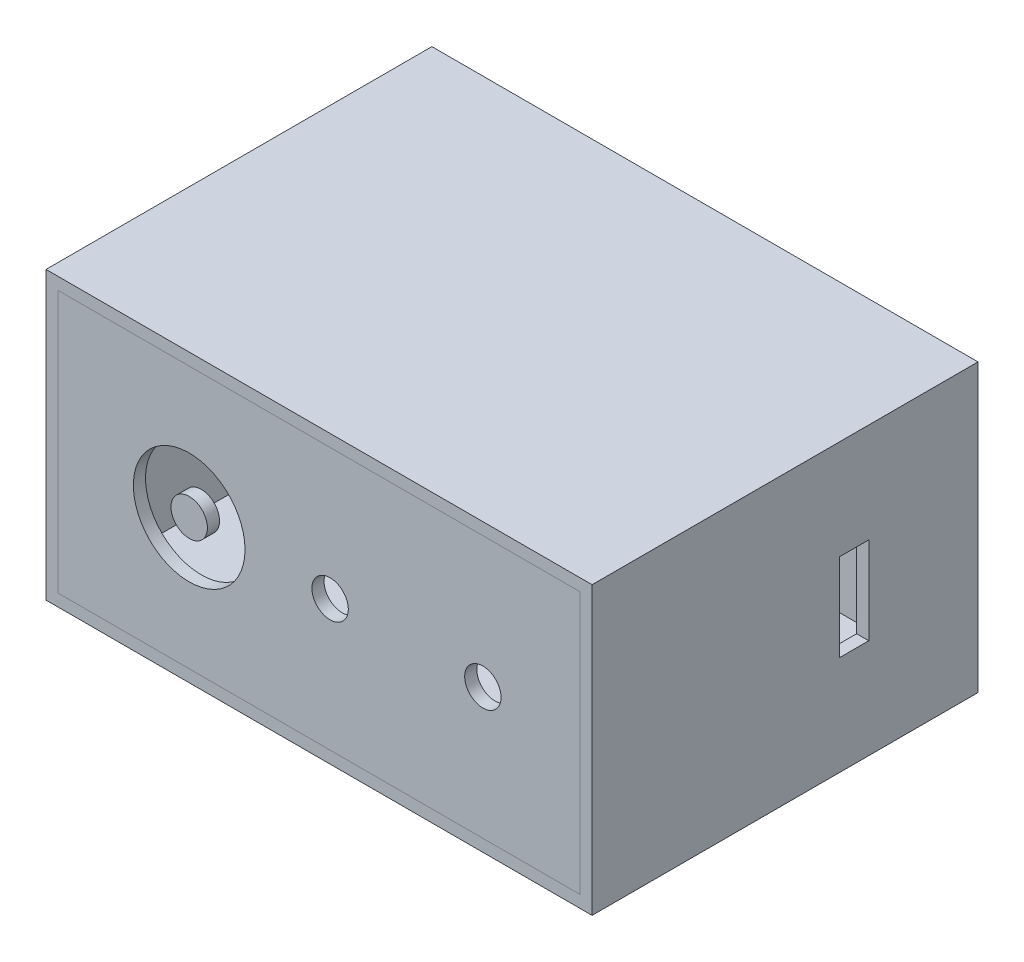
ISO-10303-21;
HEADER;
FILE_DESCRIPTION(('STEP AP214'),'2;1');
FILE_NAME('part.step','',(''),(''),'','','');
FILE_SCHEMA(('AUTOMOTIVE_DESIGN { 1 0 10303 214 1 1 1 1 }'));
ENDSEC;
DATA;
#1=APPLICATION_CONTEXT('core data for automotive mechanical design processes');
#2=APPLICATION_PROTOCOL_DEFINITION('international standard','automotive_design',2000,#1);
#3=PRODUCT_CONTEXT('',#1,'mechanical');
#4=PRODUCT('Part','Part','',(#3));
#5=PRODUCT_RELATED_PRODUCT_CATEGORY('part','',(#4));
#6=PRODUCT_DEFINITION_FORMATION('','',#4);
#7=PRODUCT_DEFINITION_CONTEXT('part definition',#1,'design');
#8=PRODUCT_DEFINITION('design','',#6,#7);
#9=PRODUCT_DEFINITION_SHAPE('','',#8);
#10=(LENGTH_UNIT() NAMED_UNIT(*) SI_UNIT(.MILLI.,.METRE.));
#11=(NAMED_UNIT(*) PLANE_ANGLE_UNIT() SI_UNIT($,.RADIAN.));
#12=(NAMED_UNIT(*) SI_UNIT($,.STERADIAN.) SOLID_ANGLE_UNIT());
#13=UNCERTAINTY_MEASURE_WITH_UNIT(LENGTH_MEASURE(1.E-05),#10,'distance_accuracy_value','');
#14=(GEOMETRIC_REPRESENTATION_CONTEXT(3) GLOBAL_UNCERTAINTY_ASSIGNED_CONTEXT((#13)) GLOBAL_UNIT_ASSIGNED_CONTEXT((#10,
#11,#12)) REPRESENTATION_CONTEXT('',''));
#15=CARTESIAN_POINT('',(0.,0.,0.));
#16=DIRECTION('',(0.,0.,1.));
#17=DIRECTION('',(1.,0.,0.));
#18=AXIS2_PLACEMENT_3D('',#15,#16,#17);
#19=CARTESIAN_POINT('',(0.,0.,0.5));
#20=DIRECTION('',(0.,0.,-1.));
#21=DIRECTION('',(-1.,0.,0.));
#22=AXIS2_PLACEMENT_3D('',#19,#20,#21);
#23=PLANE('',#22);
#24=DIRECTION('',(1.,0.,0.));
#25=VECTOR('',#24,1.);
#26=CARTESIAN_POINT('',(-11.25,5.4,0.5));
#27=LINE('',#26,#25);
#28=CARTESIAN_POINT('',(-10.75,5.4,0.5));
#29=VERTEX_POINT('',#28);
#30=CARTESIAN_POINT('',(10.75,5.4,0.5));
#31=VERTEX_POINT('',#30);
#32=EDGE_CURVE('P0_E115',#29,#31,#27,.T.);
#33=ORIENTED_EDGE('',*,*,#32,.F.);
#34=DIRECTION('',(0.,1.,0.));
#35=VECTOR('',#34,1.);
#36=CARTESIAN_POINT('',(-10.75,-5.9,0.5));
#37=LINE('',#36,#35);
#38=CARTESIAN_POINT('',(-10.75,-5.4,0.5));
#39=VERTEX_POINT('',#38);
#40=EDGE_CURVE('P0_E106',#39,#29,#37,.T.);
#41=ORIENTED_EDGE('',*,*,#40,.F.);
#42=DIRECTION('',(1.,0.,0.));
#43=VECTOR('',#42,1.);
#44=CARTESIAN_POINT('',(-11.25,-5.4,0.5));
#45=LINE('',#44,#43);
#46=CARTESIAN_POINT('',(10.75,-5.4,0.5));
#47=VERTEX_POINT('',#46);
#48=EDGE_CURVE('P0_E101',#47,#39,#45,.F.);
#49=ORIENTED_EDGE('',*,*,#48,.F.);
#50=DIRECTION('',(0.,1.,0.));
#51=VECTOR('',#50,1.);
#52=CARTESIAN_POINT('',(10.75,-5.9,0.5));
#53=LINE('',#52,#51);
#54=EDGE_CURVE('P0_E118',#31,#47,#53,.F.);
#55=ORIENTED_EDGE('',*,*,#54,.F.);
#56=EDGE_LOOP('',(#33,#41,#49,#55));
#57=FACE_BOUND('',#56,.T.);
#58=ADVANCED_FACE('P0_F16',(#57),#23,.F.);
#59=CARTESIAN_POINT('',(6.35,-1.8,5.7));
#60=DIRECTION('',(0.,0.,1.));
#61=DIRECTION('',(1.,0.,0.));
#62=AXIS2_PLACEMENT_3D('',#59,#60,#61);
#63=PLANE('',#62);
#64=DIRECTION('',(1.,0.,0.));
#65=VECTOR('',#64,1.);
#66=CARTESIAN_POINT('',(6.35,1.8,5.7));
#67=LINE('',#66,#65);
#68=CARTESIAN_POINT('',(10.75,1.8,5.7));
#69=VERTEX_POINT('',#68);
#70=CARTESIAN_POINT('',(11.25,1.8,5.7));
#71=VERTEX_POINT('',#70);
#72=EDGE_CURVE('P0_E133',#69,#71,#67,.T.);
#73=ORIENTED_EDGE('',*,*,#72,.T.);
#74=DIRECTION('',(0.,1.,0.));
#75=VECTOR('',#74,1.);
#76=CARTESIAN_POINT('',(11.25,-5.9,5.7));
#77=LINE('',#76,#75);
#78=CARTESIAN_POINT('',(11.25,-1.8,5.7));
#79=VERTEX_POINT('',#78);
#80=EDGE_CURVE('P0_E146',#71,#79,#77,.F.);
#81=ORIENTED_EDGE('',*,*,#80,.T.);
#82=DIRECTION('',(1.,0.,0.));
#83=VECTOR('',#82,1.);
#84=CARTESIAN_POINT('',(6.35,-1.8,5.7));
#85=LINE('',#84,#83);
#86=CARTESIAN_POINT('',(10.75,-1.8,5.7));
#87=VERTEX_POINT('',#86);
#88=EDGE_CURVE('P0_E19',#79,#87,#85,.F.);
#89=ORIENTED_EDGE('',*,*,#88,.T.);
#90=DIRECTION('',(0.,1.,0.));
#91=VECTOR('',#90,1.);
#92=CARTESIAN_POINT('',(10.75,-5.9,5.7));
#93=LINE('',#92,#91);
#94=EDGE_CURVE('P0_E145',#69,#87,#93,.F.);
#95=ORIENTED_EDGE('',*,*,#94,.F.);
#96=EDGE_LOOP('',(#73,#81,#89,#95));
#97=FACE_BOUND('',#96,.T.);
#98=ADVANCED_FACE('P0_F144',(#97),#63,.F.);
#99=CARTESIAN_POINT('',(6.35,-1.8,5.7));
#100=DIRECTION('',(0.,-1.,0.));
#101=DIRECTION('',(0.,0.,-1.));
#102=AXIS2_PLACEMENT_3D('',#99,#100,#101);
#103=PLANE('',#102);
#104=ORIENTED_EDGE('',*,*,#88,.F.);
#105=DIRECTION('',(0.,0.,1.));
#106=VECTOR('',#105,1.);
#107=CARTESIAN_POINT('',(11.25,-1.8,15.9));
#108=LINE('',#107,#106);
#109=CARTESIAN_POINT('',(11.25,-1.8,4.5));
#110=VERTEX_POINT('',#109);
#111=EDGE_CURVE('P0_E192',#79,#110,#108,.F.);
#112=ORIENTED_EDGE('',*,*,#111,.T.);
#113=DIRECTION('',(-1.,0.,0.));
#114=VECTOR('',#113,1.);
#115=CARTESIAN_POINT('',(6.35,-1.8,4.5));
#116=LINE('',#115,#114);
#117=CARTESIAN_POINT('',(10.75,-1.8,4.5));
#118=VERTEX_POINT('',#117);
#119=EDGE_CURVE('P0_E135',#110,#118,#116,.T.);
#120=ORIENTED_EDGE('',*,*,#119,.T.);
#121=DIRECTION('',(0.,0.,1.));
#122=VECTOR('',#121,1.);
#123=CARTESIAN_POINT('',(10.75,-1.8,15.9));
#124=LINE('',#123,#122);
#125=EDGE_CURVE('P0_E148',#87,#118,#124,.F.);
#126=ORIENTED_EDGE('',*,*,#125,.F.);
#127=EDGE_LOOP('',(#104,#112,#120,#126));
#128=FACE_BOUND('',#127,.T.);
#129=ADVANCED_FACE('P0_F149',(#128),#103,.F.);
#130=CARTESIAN_POINT('',(6.35,-1.8,4.5));
#131=DIRECTION('',(0.,0.,-1.));
#132=DIRECTION('',(-1.,0.,0.));
#133=AXIS2_PLACEMENT_3D('',#130,#131,#132);
#134=PLANE('',#133);
#135=ORIENTED_EDGE('',*,*,#119,.F.);
#136=DIRECTION('',(0.,1.,0.));
#137=VECTOR('',#136,1.);
#138=CARTESIAN_POINT('',(11.25,-5.9,4.5));
#139=LINE('',#138,#137);
#140=CARTESIAN_POINT('',(11.25,1.8,4.5));
#141=VERTEX_POINT('',#140);
#142=EDGE_CURVE('P0_E189',#110,#141,#139,.T.);
#143=ORIENTED_EDGE('',*,*,#142,.T.);
#144=DIRECTION('',(1.,0.,0.));
#145=VECTOR('',#144,1.);
#146=CARTESIAN_POINT('',(6.35,1.8,4.5));
#147=LINE('',#146,#145);
#148=CARTESIAN_POINT('',(10.75,1.8,4.5));
#149=VERTEX_POINT('',#148);
#150=EDGE_CURVE('P0_E122',#141,#149,#147,.F.);
#151=ORIENTED_EDGE('',*,*,#150,.T.);
#152=DIRECTION('',(0.,1.,0.));
#153=VECTOR('',#152,1.);
#154=CARTESIAN_POINT('',(10.75,-5.9,4.5));
#155=LINE('',#154,#153);
#156=EDGE_CURVE('P0_E161',#118,#149,#155,.T.);
#157=ORIENTED_EDGE('',*,*,#156,.F.);
#158=EDGE_LOOP('',(#135,#143,#151,#157));
#159=FACE_BOUND('',#158,.T.);
#160=ADVANCED_FACE('P0_F260',(#159),#134,.F.);
#161=CARTESIAN_POINT('',(6.35,1.8,5.7));
#162=DIRECTION('',(0.,1.,0.));
#163=DIRECTION('',(0.,0.,1.));
#164=AXIS2_PLACEMENT_3D('',#161,#162,#163);
#165=PLANE('',#164);
#166=ORIENTED_EDGE('',*,*,#150,.F.);
#167=DIRECTION('',(0.,0.,1.));
#168=VECTOR('',#167,1.);
#169=CARTESIAN_POINT('',(11.25,1.8,15.9));
#170=LINE('',#169,#168);
#171=EDGE_CURVE('P0_E186',#141,#71,#170,.T.);
#172=ORIENTED_EDGE('',*,*,#171,.T.);
#173=ORIENTED_EDGE('',*,*,#72,.F.);
#174=DIRECTION('',(0.,0.,1.));
#175=VECTOR('',#174,1.);
#176=CARTESIAN_POINT('',(10.75,1.8,15.9));
#177=LINE('',#176,#175);
#178=EDGE_CURVE('P0_E155',#149,#69,#177,.T.);
#179=ORIENTED_EDGE('',*,*,#178,.F.);
#180=EDGE_LOOP('',(#166,#172,#173,#179));
#181=FACE_BOUND('',#180,.T.);
#182=ADVANCED_FACE('P0_F257',(#181),#165,.F.);
#183=CARTESIAN_POINT('',(-11.25,5.4,15.9));
#184=DIRECTION('',(0.,-1.,0.));
#185=DIRECTION('',(0.,0.,-1.));
#186=AXIS2_PLACEMENT_3D('',#183,#184,#185);
#187=PLANE('',#186);
#188=DIRECTION('',(-1.,0.,0.));
#189=VECTOR('',#188,1.);
#190=CARTESIAN_POINT('',(0.,5.4,15.9));
#191=LINE('',#190,#189);
#192=CARTESIAN_POINT('',(10.75,5.4,15.9));
#193=VERTEX_POINT('',#192);
#194=CARTESIAN_POINT('',(-10.75,5.4,15.9));
#195=VERTEX_POINT('',#194);
#196=EDGE_CURVE('P0_E126',#193,#195,#191,.T.);
#197=ORIENTED_EDGE('',*,*,#196,.T.);
#198=DIRECTION('',(0.,0.,-1.));
#199=VECTOR('',#198,1.);
#200=CARTESIAN_POINT('',(-10.75,5.4,15.9));
#201=LINE('',#200,#199);
#202=EDGE_CURVE('P0_E111',#29,#195,#201,.F.);
#203=ORIENTED_EDGE('',*,*,#202,.F.);
#204=ORIENTED_EDGE('',*,*,#32,.T.);
#205=DIRECTION('',(0.,0.,1.));
#206=VECTOR('',#205,1.);
#207=CARTESIAN_POINT('',(10.75,5.4,15.9));
#208=LINE('',#207,#206);
#209=EDGE_CURVE('P0_E195',#193,#31,#208,.F.);
#210=ORIENTED_EDGE('',*,*,#209,.F.);
#211=EDGE_LOOP('',(#197,#203,#204,#210));
#212=FACE_BOUND('',#211,.T.);
#213=ADVANCED_FACE('P0_F125',(#212),#187,.T.);
#214=CARTESIAN_POINT('',(-10.75,-5.9,15.9));
#215=DIRECTION('',(1.,0.,0.));
#216=DIRECTION('',(0.,0.,-1.));
#217=AXIS2_PLACEMENT_3D('',#214,#215,#216);
#218=PLANE('',#217);
#219=DIRECTION('',(0.,1.,0.));
#220=VECTOR('',#219,1.);
#221=CARTESIAN_POINT('',(-10.75,0.,15.9));
#222=LINE('',#221,#220);
#223=CARTESIAN_POINT('',(-10.75,-5.4,15.9));
#224=VERTEX_POINT('',#223);
#225=EDGE_CURVE('P0_E170',#195,#224,#222,.F.);
#226=ORIENTED_EDGE('',*,*,#225,.T.);
#227=DIRECTION('',(0.,0.,1.));
#228=VECTOR('',#227,1.);
#229=CARTESIAN_POINT('',(-10.75,-5.4,15.9));
#230=LINE('',#229,#228);
#231=EDGE_CURVE('P0_E113',#39,#224,#230,.T.);
#232=ORIENTED_EDGE('',*,*,#231,.F.);
#233=ORIENTED_EDGE('',*,*,#40,.T.);
#234=ORIENTED_EDGE('',*,*,#202,.T.);
#235=EDGE_LOOP('',(#226,#232,#233,#234));
#236=FACE_BOUND('',#235,.T.);
#237=ADVANCED_FACE('P0_F109',(#236),#218,.T.);
#238=CARTESIAN_POINT('',(-11.25,-5.4,15.9));
#239=DIRECTION('',(0.,1.,0.));
#240=DIRECTION('',(0.,0.,1.));
#241=AXIS2_PLACEMENT_3D('',#238,#239,#240);
#242=PLANE('',#241);
#243=DIRECTION('',(-1.,0.,0.));
#244=VECTOR('',#243,1.);
#245=CARTESIAN_POINT('',(0.,-5.4,15.9));
#246=LINE('',#245,#244);
#247=CARTESIAN_POINT('',(10.75,-5.4,15.9));
#248=VERTEX_POINT('',#247);
#249=EDGE_CURVE('P0_E165',#224,#248,#246,.F.);
#250=ORIENTED_EDGE('',*,*,#249,.T.);
#251=DIRECTION('',(0.,0.,1.));
#252=VECTOR('',#251,1.);
#253=CARTESIAN_POINT('',(10.75,-5.4,15.9));
#254=LINE('',#253,#252);
#255=EDGE_CURVE('P0_E153',#47,#248,#254,.T.);
#256=ORIENTED_EDGE('',*,*,#255,.F.);
#257=ORIENTED_EDGE('',*,*,#48,.T.);
#258=ORIENTED_EDGE('',*,*,#231,.T.);
#259=EDGE_LOOP('',(#250,#256,#257,#258));
#260=FACE_BOUND('',#259,.T.);
#261=ADVANCED_FACE('P0_F164',(#260),#242,.T.);
#262=CARTESIAN_POINT('',(10.75,-5.9,15.9));
#263=DIRECTION('',(-1.,0.,0.));
#264=DIRECTION('',(0.,0.,1.));
#265=AXIS2_PLACEMENT_3D('',#262,#263,#264);
#266=PLANE('',#265);
#267=DIRECTION('',(0.,1.,0.));
#268=VECTOR('',#267,1.);
#269=CARTESIAN_POINT('',(10.75,0.,15.9));
#270=LINE('',#269,#268);
#271=EDGE_CURVE('P0_E172',#248,#193,#270,.T.);
#272=ORIENTED_EDGE('',*,*,#271,.T.);
#273=ORIENTED_EDGE('',*,*,#209,.T.);
#274=ORIENTED_EDGE('',*,*,#54,.T.);
#275=ORIENTED_EDGE('',*,*,#255,.T.);
#276=EDGE_LOOP('',(#272,#273,#274,#275));
#277=FACE_BOUND('',#276,.T.);
#278=ORIENTED_EDGE('',*,*,#94,.T.);
#279=ORIENTED_EDGE('',*,*,#125,.T.);
#280=ORIENTED_EDGE('',*,*,#156,.T.);
#281=ORIENTED_EDGE('',*,*,#178,.T.);
#282=EDGE_LOOP('',(#278,#279,#280,#281));
#283=FACE_BOUND('',#282,.T.);
#284=ADVANCED_FACE('P0_F197',(#277,#283),#266,.T.);
#285=CARTESIAN_POINT('',(-11.25,-5.9,15.9));
#286=DIRECTION('',(0.,1.,0.));
#287=DIRECTION('',(0.,0.,1.));
#288=AXIS2_PLACEMENT_3D('',#285,#286,#287);
#289=PLANE('',#288);
#290=DIRECTION('',(0.,0.,1.));
#291=VECTOR('',#290,1.);
#292=CARTESIAN_POINT('',(11.25,-5.9,15.9));
#293=LINE('',#292,#291);
#294=CARTESIAN_POINT('',(11.25,-5.9,0.));
#295=VERTEX_POINT('',#294);
#296=CARTESIAN_POINT('',(11.25,-5.9,15.9));
#297=VERTEX_POINT('',#296);
#298=EDGE_CURVE('P0_E183',#295,#297,#293,.T.);
#299=ORIENTED_EDGE('',*,*,#298,.T.);
#300=DIRECTION('',(-1.,0.,0.));
#301=VECTOR('',#300,1.);
#302=CARTESIAN_POINT('',(0.,-5.9,15.9));
#303=LINE('',#302,#301);
#304=CARTESIAN_POINT('',(-11.25,-5.9,15.9));
#305=VERTEX_POINT('',#304);
#306=EDGE_CURVE('P0_E181',#297,#305,#303,.T.);
#307=ORIENTED_EDGE('',*,*,#306,.T.);
#308=DIRECTION('',(0.,0.,-1.));
#309=VECTOR('',#308,1.);
#310=CARTESIAN_POINT('',(-11.25,-5.9,15.9));
#311=LINE('',#310,#309);
#312=CARTESIAN_POINT('',(-11.25,-5.9,0.));
#313=VERTEX_POINT('',#312);
#314=EDGE_CURVE('P0_E200',#305,#313,#311,.T.);
#315=ORIENTED_EDGE('',*,*,#314,.T.);
#316=DIRECTION('',(-1.,0.,0.));
#317=VECTOR('',#316,1.);
#318=CARTESIAN_POINT('',(0.,-5.9,0.));
#319=LINE('',#318,#317);
#320=EDGE_CURVE('P0_E208',#295,#313,#319,.T.);
#321=ORIENTED_EDGE('',*,*,#320,.F.);
#322=EDGE_LOOP('',(#299,#307,#315,#321));
#323=FACE_BOUND('',#322,.T.);
#324=ADVANCED_FACE('P0_F245',(#323),#289,.F.);
#325=CARTESIAN_POINT('',(11.25,-5.9,15.9));
#326=DIRECTION('',(-1.,0.,0.));
#327=DIRECTION('',(0.,0.,1.));
#328=AXIS2_PLACEMENT_3D('',#325,#326,#327);
#329=PLANE('',#328);
#330=DIRECTION('',(0.,0.,-1.));
#331=VECTOR('',#330,1.);
#332=CARTESIAN_POINT('',(11.25,5.9,15.9));
#333=LINE('',#332,#331);
#334=CARTESIAN_POINT('',(11.25,5.9,0.));
#335=VERTEX_POINT('',#334);
#336=CARTESIAN_POINT('',(11.25,5.9,15.9));
#337=VERTEX_POINT('',#336);
#338=EDGE_CURVE('P0_E211',#335,#337,#333,.F.);
#339=ORIENTED_EDGE('',*,*,#338,.T.);
#340=DIRECTION('',(0.,1.,0.));
#341=VECTOR('',#340,1.);
#342=CARTESIAN_POINT('',(11.25,0.,15.9));
#343=LINE('',#342,#341);
#344=EDGE_CURVE('P0_E175',#337,#297,#343,.F.);
#345=ORIENTED_EDGE('',*,*,#344,.T.);
#346=ORIENTED_EDGE('',*,*,#298,.F.);
#347=DIRECTION('',(0.,1.,0.));
#348=VECTOR('',#347,1.);
#349=CARTESIAN_POINT('',(11.25,0.,0.));
#350=LINE('',#349,#348);
#351=EDGE_CURVE('P0_E205',#335,#295,#350,.F.);
#352=ORIENTED_EDGE('',*,*,#351,.F.);
#353=EDGE_LOOP('',(#339,#345,#346,#352));
#354=FACE_BOUND('',#353,.T.);
#355=ORIENTED_EDGE('',*,*,#142,.F.);
#356=ORIENTED_EDGE('',*,*,#111,.F.);
#357=ORIENTED_EDGE('',*,*,#80,.F.);
#358=ORIENTED_EDGE('',*,*,#171,.F.);
#359=EDGE_LOOP('',(#355,#356,#357,#358));
#360=FACE_BOUND('',#359,.T.);
#361=ADVANCED_FACE('P0_F226',(#354,#360),#329,.F.);
#362=CARTESIAN_POINT('',(0.,0.,15.9));
#363=DIRECTION('',(0.,0.,-1.));
#364=DIRECTION('',(-1.,0.,0.));
#365=AXIS2_PLACEMENT_3D('',#362,#363,#364);
#366=PLANE('',#365);
#367=ORIENTED_EDGE('',*,*,#249,.F.);
#368=ORIENTED_EDGE('',*,*,#225,.F.);
#369=ORIENTED_EDGE('',*,*,#196,.F.);
#370=ORIENTED_EDGE('',*,*,#271,.F.);
#371=EDGE_LOOP('',(#367,#368,#369,#370));
#372=FACE_BOUND('',#371,.T.);
#373=DIRECTION('',(1.,0.,0.));
#374=VECTOR('',#373,1.);
#375=CARTESIAN_POINT('',(-11.25,5.9,15.9));
#376=LINE('',#375,#374);
#377=CARTESIAN_POINT('',(-11.25,5.9,15.9));
#378=VERTEX_POINT('',#377);
#379=EDGE_CURVE('P0_E214',#337,#378,#376,.F.);
#380=ORIENTED_EDGE('',*,*,#379,.T.);
#381=DIRECTION('',(0.,1.,0.));
#382=VECTOR('',#381,1.);
#383=CARTESIAN_POINT('',(-11.25,-5.9,15.9));
#384=LINE('',#383,#382);
#385=EDGE_CURVE('P0_E198',#378,#305,#384,.F.);
#386=ORIENTED_EDGE('',*,*,#385,.T.);
#387=ORIENTED_EDGE('',*,*,#306,.F.);
#388=ORIENTED_EDGE('',*,*,#344,.F.);
#389=EDGE_LOOP('',(#380,#386,#387,#388));
#390=FACE_BOUND('',#389,.T.);
#391=ADVANCED_FACE('P0_F168',(#372,#390),#366,.F.);
#392=CARTESIAN_POINT('',(-11.25,-5.9,15.9));
#393=DIRECTION('',(1.,0.,0.));
#394=DIRECTION('',(0.,0.,-1.));
#395=AXIS2_PLACEMENT_3D('',#392,#393,#394);
#396=PLANE('',#395);
#397=ORIENTED_EDGE('',*,*,#314,.F.);
#398=ORIENTED_EDGE('',*,*,#385,.F.);
#399=DIRECTION('',(0.,0.,-1.));
#400=VECTOR('',#399,1.);
#401=CARTESIAN_POINT('',(-11.25,5.9,15.9));
#402=LINE('',#401,#400);
#403=CARTESIAN_POINT('',(-11.25,5.9,0.));
#404=VERTEX_POINT('',#403);
#405=EDGE_CURVE('P0_E25',#378,#404,#402,.T.);
#406=ORIENTED_EDGE('',*,*,#405,.T.);
#407=DIRECTION('',(0.,1.,0.));
#408=VECTOR('',#407,1.);
#409=CARTESIAN_POINT('',(-11.25,0.,0.));
#410=LINE('',#409,#408);
#411=EDGE_CURVE('P0_E33',#313,#404,#410,.T.);
#412=ORIENTED_EDGE('',*,*,#411,.F.);
#413=EDGE_LOOP('',(#397,#398,#406,#412));
#414=FACE_BOUND('',#413,.T.);
#415=ADVANCED_FACE('P0_F221',(#414),#396,.F.);
#416=CARTESIAN_POINT('',(0.,0.,0.));
#417=DIRECTION('',(0.,0.,-1.));
#418=DIRECTION('',(-1.,0.,0.));
#419=AXIS2_PLACEMENT_3D('',#416,#417,#418);
#420=PLANE('',#419);
#421=ORIENTED_EDGE('',*,*,#411,.T.);
#422=DIRECTION('',(1.,0.,0.));
#423=VECTOR('',#422,1.);
#424=CARTESIAN_POINT('',(-11.25,5.9,0.));
#425=LINE('',#424,#423);
#426=EDGE_CURVE('P0_E11',#404,#335,#425,.T.);
#427=ORIENTED_EDGE('',*,*,#426,.T.);
#428=ORIENTED_EDGE('',*,*,#351,.T.);
#429=ORIENTED_EDGE('',*,*,#320,.T.);
#430=EDGE_LOOP('',(#421,#427,#428,#429));
#431=FACE_BOUND('',#430,.T.);
#432=ADVANCED_FACE('P0_F230',(#431),#420,.T.);
#433=CARTESIAN_POINT('',(-11.25,5.9,15.9));
#434=DIRECTION('',(0.,-1.,0.));
#435=DIRECTION('',(0.,0.,-1.));
#436=AXIS2_PLACEMENT_3D('',#433,#434,#435);
#437=PLANE('',#436);
#438=ORIENTED_EDGE('',*,*,#405,.F.);
#439=ORIENTED_EDGE('',*,*,#379,.F.);
#440=ORIENTED_EDGE('',*,*,#338,.F.);
#441=ORIENTED_EDGE('',*,*,#426,.F.);
#442=EDGE_LOOP('',(#438,#439,#440,#441));
#443=FACE_BOUND('',#442,.T.);
#444=ADVANCED_FACE('P0_F224',(#443),#437,.F.);
#445=CLOSED_SHELL('',(#58,#98,#129,#160,#182,#213,#237,#261,#284,#324,#361,#391,#415,#432,#444));
#446=MANIFOLD_SOLID_BREP('P0_B1',#445);
#447=CARTESIAN_POINT('',(0.,0.,15.4));
#448=DIRECTION('',(0.,0.,-1.));
#449=DIRECTION('',(-1.,0.,0.));
#450=AXIS2_PLACEMENT_3D('',#447,#448,#449);
#451=PLANE('',#450);
#452=CARTESIAN_POINT('',(-5.35,0.,15.4));
#453=DIRECTION('',(0.,0.,1.));
#454=DIRECTION('',(1.,0.,0.));
#455=AXIS2_PLACEMENT_3D('',#452,#453,#454);
#456=CIRCLE('',#455,0.750000000000002);
#457=CARTESIAN_POINT('',(-4.6,0.,15.4));
#458=VERTEX_POINT('',#457);
#459=EDGE_CURVE('P1_E17',#458,#458,#456,.T.);
#460=ORIENTED_EDGE('',*,*,#459,.F.);
#461=EDGE_LOOP('',(#460));
#462=FACE_BOUND('',#461,.T.);
#463=ADVANCED_FACE('P1_F14',(#462),#451,.T.);
#464=CARTESIAN_POINT('',(-5.35,0.,15.4));
#465=DIRECTION('',(0.,0.,1.));
#466=DIRECTION('',(1.,0.,0.));
#467=AXIS2_PLACEMENT_3D('',#464,#465,#466);
#468=CYLINDRICAL_SURFACE('',#467,0.750000000000002);
#469=CARTESIAN_POINT('',(-5.35,0.,15.9));
#470=DIRECTION('',(0.,0.,1.));
#471=DIRECTION('',(1.,0.,0.));
#472=AXIS2_PLACEMENT_3D('',#469,#470,#471);
#473=CIRCLE('',#472,0.750000000000002);
#474=CARTESIAN_POINT('',(-4.6,0.,15.9));
#475=VERTEX_POINT('',#474);
#476=EDGE_CURVE('P1_E10',#475,#475,#473,.F.);
#477=ORIENTED_EDGE('',*,*,#476,.T.);
#478=EDGE_LOOP('',(#477));
#479=FACE_BOUND('',#478,.T.);
#480=ORIENTED_EDGE('',*,*,#459,.T.);
#481=EDGE_LOOP('',(#480));
#482=FACE_BOUND('',#481,.T.);
#483=ADVANCED_FACE('P1_F26',(#479,#482),#468,.T.);
#484=CARTESIAN_POINT('',(0.,0.,15.9));
#485=DIRECTION('',(0.,0.,-1.));
#486=DIRECTION('',(-1.,0.,0.));
#487=AXIS2_PLACEMENT_3D('',#484,#485,#486);
#488=PLANE('',#487);
#489=ORIENTED_EDGE('',*,*,#476,.F.);
#490=EDGE_LOOP('',(#489));
#491=FACE_BOUND('',#490,.T.);
#492=ADVANCED_FACE('P1_F33',(#491),#488,.F.);
#493=CLOSED_SHELL('',(#463,#483,#492));
#494=MANIFOLD_SOLID_BREP('P1_B1',#493);
#495=CARTESIAN_POINT('',(0.,0.,15.9));
#496=DIRECTION('',(0.,0.,-1.));
#497=DIRECTION('',(-1.,0.,0.));
#498=AXIS2_PLACEMENT_3D('',#495,#496,#497);
#499=PLANE('',#498);
#500=DIRECTION('',(1.,0.,0.));
#501=VECTOR('',#500,1.);
#502=CARTESIAN_POINT('',(-10.75,5.4,15.9));
#503=LINE('',#502,#501);
#504=CARTESIAN_POINT('',(-10.75,5.4,15.9));
#505=VERTEX_POINT('',#504);
#506=CARTESIAN_POINT('',(10.75,5.4,15.9));
#507=VERTEX_POINT('',#506);
#508=EDGE_CURVE('P2_E207',#505,#507,#503,.T.);
#509=ORIENTED_EDGE('',*,*,#508,.F.);
#510=DIRECTION('',(0.,1.,0.));
#511=VECTOR('',#510,1.);
#512=CARTESIAN_POINT('',(-10.75,-5.4,15.9));
#513=LINE('',#512,#511);
#514=CARTESIAN_POINT('',(-10.75,-5.4,15.9));
#515=VERTEX_POINT('',#514);
#516=EDGE_CURVE('P2_E54',#515,#505,#513,.T.);
#517=ORIENTED_EDGE('',*,*,#516,.F.);
#518=DIRECTION('',(1.,0.,0.));
#519=VECTOR('',#518,1.);
#520=CARTESIAN_POINT('',(-10.75,-5.4,15.9));
#521=LINE('',#520,#519);
#522=CARTESIAN_POINT('',(10.75,-5.4,15.9));
#523=VERTEX_POINT('',#522);
#524=EDGE_CURVE('P2_E56',#523,#515,#521,.F.);
#525=ORIENTED_EDGE('',*,*,#524,.F.);
#526=DIRECTION('',(0.,1.,0.));
#527=VECTOR('',#526,1.);
#528=CARTESIAN_POINT('',(10.75,-5.4,15.9));
#529=LINE('',#528,#527);
#530=EDGE_CURVE('P2_E59',#507,#523,#529,.F.);
#531=ORIENTED_EDGE('',*,*,#530,.F.);
#532=EDGE_LOOP('',(#509,#517,#525,#531));
#533=FACE_BOUND('',#532,.T.);
#534=CARTESIAN_POINT('',(6.75,0.,15.9));
#535=DIRECTION('',(0.,0.,1.));
#536=DIRECTION('',(1.,0.,0.));
#537=AXIS2_PLACEMENT_3D('',#534,#535,#536);
#538=CIRCLE('',#537,0.749999999999999);
#539=CARTESIAN_POINT('',(7.5,0.,15.9));
#540=VERTEX_POINT('',#539);
#541=EDGE_CURVE('P2_E72',#540,#540,#538,.F.);
#542=ORIENTED_EDGE('',*,*,#541,.T.);
#543=EDGE_LOOP('',(#542));
#544=FACE_BOUND('',#543,.T.);
#545=CARTESIAN_POINT('',(-5.35,0.,15.9));
#546=DIRECTION('',(0.,0.,1.));
#547=DIRECTION('',(1.,0.,0.));
#548=AXIS2_PLACEMENT_3D('',#545,#546,#547);
#549=CIRCLE('',#548,2.29999999999999);
#550=CARTESIAN_POINT('',(-3.05000000000001,0.,15.9));
#551=VERTEX_POINT('',#550);
#552=EDGE_CURVE('P2_E94',#551,#551,#549,.F.);
#553=ORIENTED_EDGE('',*,*,#552,.T.);
#554=EDGE_LOOP('',(#553));
#555=FACE_BOUND('',#554,.T.);
#556=CARTESIAN_POINT('',(0.455450907590688,0.,15.9));
#557=DIRECTION('',(0.,0.,1.));
#558=DIRECTION('',(1.,0.,0.));
#559=AXIS2_PLACEMENT_3D('',#556,#557,#558);
#560=CIRCLE('',#559,0.75);
#561=CARTESIAN_POINT('',(1.20545090759069,0.,15.9));
#562=VERTEX_POINT('',#561);
#563=EDGE_CURVE('P2_E19',#562,#562,#560,.F.);
#564=ORIENTED_EDGE('',*,*,#563,.T.);
#565=EDGE_LOOP('',(#564));
#566=FACE_BOUND('',#565,.T.);
#567=ADVANCED_FACE('P2_F16',(#533,#544,#555,#566),#499,.F.);
#568=CARTESIAN_POINT('',(0.455450907590688,0.,15.4));
#569=DIRECTION('',(0.,0.,1.));
#570=DIRECTION('',(1.,0.,0.));
#571=AXIS2_PLACEMENT_3D('',#568,#569,#570);
#572=CYLINDRICAL_SURFACE('',#571,0.75);
#573=ORIENTED_EDGE('',*,*,#563,.F.);
#574=EDGE_LOOP('',(#573));
#575=FACE_BOUND('',#574,.T.);
#576=CARTESIAN_POINT('',(0.455450907590688,0.,15.4));
#577=DIRECTION('',(0.,0.,1.));
#578=DIRECTION('',(1.,0.,0.));
#579=AXIS2_PLACEMENT_3D('',#576,#577,#578);
#580=CIRCLE('',#579,0.75);
#581=CARTESIAN_POINT('',(1.20545090759069,0.,15.4));
#582=VERTEX_POINT('',#581);
#583=EDGE_CURVE('P2_E90',#582,#582,#580,.T.);
#584=ORIENTED_EDGE('',*,*,#583,.F.);
#585=EDGE_LOOP('',(#584));
#586=FACE_BOUND('',#585,.T.);
#587=ADVANCED_FACE('P2_F102',(#575,#586),#572,.F.);
#588=CARTESIAN_POINT('',(-5.35,0.,15.4));
#589=DIRECTION('',(0.,0.,1.));
#590=DIRECTION('',(1.,0.,0.));
#591=AXIS2_PLACEMENT_3D('',#588,#589,#590);
#592=CYLINDRICAL_SURFACE('',#591,2.29999999999999);
#593=ORIENTED_EDGE('',*,*,#552,.F.);
#594=EDGE_LOOP('',(#593));
#595=FACE_BOUND('',#594,.T.);
#596=CARTESIAN_POINT('',(-5.35,0.,15.4));
#597=DIRECTION('',(0.,0.,1.));
#598=DIRECTION('',(1.,0.,0.));
#599=AXIS2_PLACEMENT_3D('',#596,#597,#598);
#600=CIRCLE('',#599,2.29999999999999);
#601=CARTESIAN_POINT('',(-3.05000000000001,0.,15.4));
#602=VERTEX_POINT('',#601);
#603=EDGE_CURVE('P2_E87',#602,#602,#600,.T.);
#604=ORIENTED_EDGE('',*,*,#603,.F.);
#605=EDGE_LOOP('',(#604));
#606=FACE_BOUND('',#605,.T.);
#607=ADVANCED_FACE('P2_F105',(#595,#606),#592,.F.);
#608=CARTESIAN_POINT('',(6.75,0.,15.4));
#609=DIRECTION('',(0.,0.,1.));
#610=DIRECTION('',(1.,0.,0.));
#611=AXIS2_PLACEMENT_3D('',#608,#609,#610);
#612=CYLINDRICAL_SURFACE('',#611,0.749999999999999);
#613=ORIENTED_EDGE('',*,*,#541,.F.);
#614=EDGE_LOOP('',(#613));
#615=FACE_BOUND('',#614,.T.);
#616=CARTESIAN_POINT('',(6.75,0.,15.4));
#617=DIRECTION('',(0.,0.,1.));
#618=DIRECTION('',(1.,0.,0.));
#619=AXIS2_PLACEMENT_3D('',#616,#617,#618);
#620=CIRCLE('',#619,0.749999999999999);
#621=CARTESIAN_POINT('',(7.5,0.,15.4));
#622=VERTEX_POINT('',#621);
#623=EDGE_CURVE('P2_E83',#622,#622,#620,.T.);
#624=ORIENTED_EDGE('',*,*,#623,.F.);
#625=EDGE_LOOP('',(#624));
#626=FACE_BOUND('',#625,.T.);
#627=ADVANCED_FACE('P2_F129',(#615,#626),#612,.F.);
#628=CARTESIAN_POINT('',(10.75,-5.4,15.4));
#629=DIRECTION('',(1.,0.,0.));
#630=DIRECTION('',(0.,0.,-1.));
#631=AXIS2_PLACEMENT_3D('',#628,#629,#630);
#632=PLANE('',#631);
#633=DIRECTION('',(0.,1.,0.));
#634=VECTOR('',#633,1.);
#635=CARTESIAN_POINT('',(10.75,0.,15.4));
#636=LINE('',#635,#634);
#637=CARTESIAN_POINT('',(10.75,5.4,15.4));
#638=VERTEX_POINT('',#637);
#639=CARTESIAN_POINT('',(10.75,-5.4,15.4));
#640=VERTEX_POINT('',#639);
#641=EDGE_CURVE('P2_E86',#638,#640,#636,.F.);
#642=ORIENTED_EDGE('',*,*,#641,.F.);
#643=DIRECTION('',(0.,0.,1.));
#644=VECTOR('',#643,1.);
#645=CARTESIAN_POINT('',(10.75,5.4,15.4));
#646=LINE('',#645,#644);
#647=EDGE_CURVE('P2_E70',#507,#638,#646,.F.);
#648=ORIENTED_EDGE('',*,*,#647,.F.);
#649=ORIENTED_EDGE('',*,*,#530,.T.);
#650=DIRECTION('',(0.,0.,-1.));
#651=VECTOR('',#650,1.);
#652=CARTESIAN_POINT('',(10.75,-5.4,15.4));
#653=LINE('',#652,#651);
#654=EDGE_CURVE('P2_E64',#640,#523,#653,.F.);
#655=ORIENTED_EDGE('',*,*,#654,.F.);
#656=EDGE_LOOP('',(#642,#648,#649,#655));
#657=FACE_BOUND('',#656,.T.);
#658=ADVANCED_FACE('P2_F67',(#657),#632,.T.);
#659=CARTESIAN_POINT('',(-10.75,-5.4,15.4));
#660=DIRECTION('',(0.,-1.,0.));
#661=DIRECTION('',(0.,0.,-1.));
#662=AXIS2_PLACEMENT_3D('',#659,#660,#661);
#663=PLANE('',#662);
#664=DIRECTION('',(-1.,0.,0.));
#665=VECTOR('',#664,1.);
#666=CARTESIAN_POINT('',(0.,-5.4,15.4));
#667=LINE('',#666,#665);
#668=CARTESIAN_POINT('',(-10.75,-5.4,15.4));
#669=VERTEX_POINT('',#668);
#670=EDGE_CURVE('P2_E76',#640,#669,#667,.T.);
#671=ORIENTED_EDGE('',*,*,#670,.F.);
#672=ORIENTED_EDGE('',*,*,#654,.T.);
#673=ORIENTED_EDGE('',*,*,#524,.T.);
#674=DIRECTION('',(0.,0.,1.));
#675=VECTOR('',#674,1.);
#676=CARTESIAN_POINT('',(-10.75,-5.4,15.4));
#677=LINE('',#676,#675);
#678=EDGE_CURVE('P2_E79',#669,#515,#677,.T.);
#679=ORIENTED_EDGE('',*,*,#678,.F.);
#680=EDGE_LOOP('',(#671,#672,#673,#679));
#681=FACE_BOUND('',#680,.T.);
#682=ADVANCED_FACE('P2_F74',(#681),#663,.T.);
#683=CARTESIAN_POINT('',(-10.75,-5.4,15.4));
#684=DIRECTION('',(-1.,0.,0.));
#685=DIRECTION('',(0.,0.,1.));
#686=AXIS2_PLACEMENT_3D('',#683,#684,#685);
#687=PLANE('',#686);
#688=DIRECTION('',(0.,1.,0.));
#689=VECTOR('',#688,1.);
#690=CARTESIAN_POINT('',(-10.75,0.,15.4));
#691=LINE('',#690,#689);
#692=CARTESIAN_POINT('',(-10.75,5.4,15.4));
#693=VERTEX_POINT('',#692);
#694=EDGE_CURVE('P2_E25',#669,#693,#691,.T.);
#695=ORIENTED_EDGE('',*,*,#694,.F.);
#696=ORIENTED_EDGE('',*,*,#678,.T.);
#697=ORIENTED_EDGE('',*,*,#516,.T.);
#698=DIRECTION('',(0.,0.,1.));
#699=VECTOR('',#698,1.);
#700=CARTESIAN_POINT('',(-10.75,5.4,15.4));
#701=LINE('',#700,#699);
#702=EDGE_CURVE('P2_E34',#693,#505,#701,.T.);
#703=ORIENTED_EDGE('',*,*,#702,.F.);
#704=EDGE_LOOP('',(#695,#696,#697,#703));
#705=FACE_BOUND('',#704,.T.);
#706=ADVANCED_FACE('P2_F117',(#705),#687,.T.);
#707=CARTESIAN_POINT('',(-10.75,5.4,15.4));
#708=DIRECTION('',(0.,1.,0.));
#709=DIRECTION('',(0.,0.,1.));
#710=AXIS2_PLACEMENT_3D('',#707,#708,#709);
#711=PLANE('',#710);
#712=DIRECTION('',(-1.,0.,0.));
#713=VECTOR('',#712,1.);
#714=CARTESIAN_POINT('',(0.,5.4,15.4));
#715=LINE('',#714,#713);
#716=EDGE_CURVE('P2_E11',#693,#638,#715,.F.);
#717=ORIENTED_EDGE('',*,*,#716,.F.);
#718=ORIENTED_EDGE('',*,*,#702,.T.);
#719=ORIENTED_EDGE('',*,*,#508,.T.);
#720=ORIENTED_EDGE('',*,*,#647,.T.);
#721=EDGE_LOOP('',(#717,#718,#719,#720));
#722=FACE_BOUND('',#721,.T.);
#723=ADVANCED_FACE('P2_F110',(#722),#711,.T.);
#724=CARTESIAN_POINT('',(0.,0.,15.4));
#725=DIRECTION('',(0.,0.,-1.));
#726=DIRECTION('',(-1.,0.,0.));
#727=AXIS2_PLACEMENT_3D('',#724,#725,#726);
#728=PLANE('',#727);
#729=ORIENTED_EDGE('',*,*,#694,.T.);
#730=ORIENTED_EDGE('',*,*,#716,.T.);
#731=ORIENTED_EDGE('',*,*,#641,.T.);
#732=ORIENTED_EDGE('',*,*,#670,.T.);
#733=EDGE_LOOP('',(#729,#730,#731,#732));
#734=FACE_BOUND('',#733,.T.);
#735=ORIENTED_EDGE('',*,*,#623,.T.);
#736=EDGE_LOOP('',(#735));
#737=FACE_BOUND('',#736,.T.);
#738=ORIENTED_EDGE('',*,*,#603,.T.);
#739=EDGE_LOOP('',(#738));
#740=FACE_BOUND('',#739,.T.);
#741=ORIENTED_EDGE('',*,*,#583,.T.);
#742=EDGE_LOOP('',(#741));
#743=FACE_BOUND('',#742,.T.);
#744=ADVANCED_FACE('P2_F108',(#734,#737,#740,#743),#728,.T.);
#745=CLOSED_SHELL('',(#567,#587,#607,#627,#658,#682,#706,#723,#744));
#746=MANIFOLD_SOLID_BREP('P2_B1',#745);
#747=ADVANCED_BREP_SHAPE_REPRESENTATION('',(#18,#446,#494,#746),#14);
#748=SHAPE_DEFINITION_REPRESENTATION(#9,#747);
ENDSEC;
END-ISO-10303-21;
